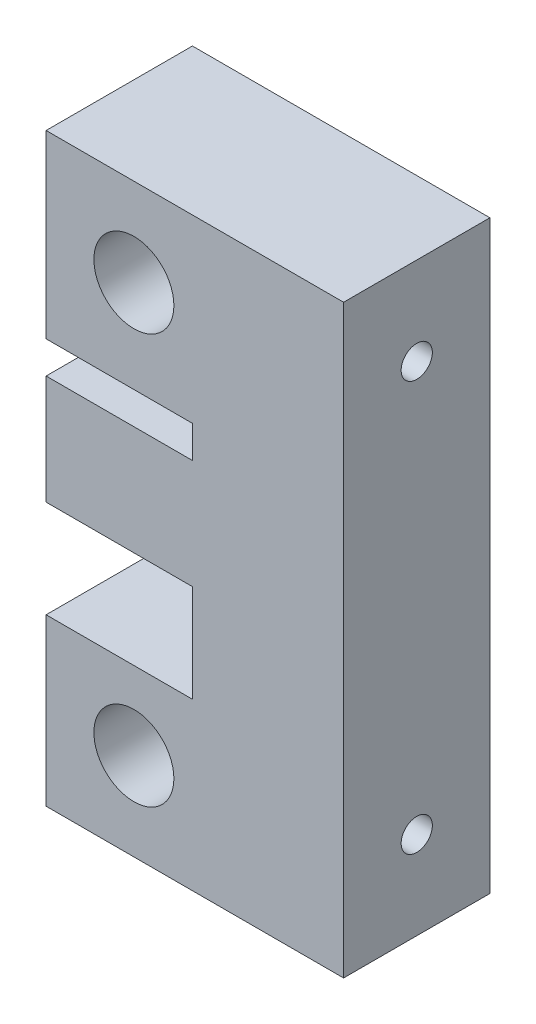
ISO-10303-21;
HEADER;
FILE_DESCRIPTION(('STEP AP214'),'2;1');
FILE_NAME('part.step','',(''),(''),'','','');
FILE_SCHEMA(('AUTOMOTIVE_DESIGN { 1 0 10303 214 1 1 1 1 }'));
ENDSEC;
DATA;
#1=APPLICATION_CONTEXT('core data for automotive mechanical design processes');
#2=APPLICATION_PROTOCOL_DEFINITION('international standard','automotive_design',2000,#1);
#3=PRODUCT_CONTEXT('',#1,'mechanical');
#4=PRODUCT('Part','Part','',(#3));
#5=PRODUCT_RELATED_PRODUCT_CATEGORY('part','',(#4));
#6=PRODUCT_DEFINITION_FORMATION('','',#4);
#7=PRODUCT_DEFINITION_CONTEXT('part definition',#1,'design');
#8=PRODUCT_DEFINITION('design','',#6,#7);
#9=PRODUCT_DEFINITION_SHAPE('','',#8);
#10=(LENGTH_UNIT() NAMED_UNIT(*) SI_UNIT(.MILLI.,.METRE.));
#11=(NAMED_UNIT(*) PLANE_ANGLE_UNIT() SI_UNIT($,.RADIAN.));
#12=(NAMED_UNIT(*) SI_UNIT($,.STERADIAN.) SOLID_ANGLE_UNIT());
#13=UNCERTAINTY_MEASURE_WITH_UNIT(LENGTH_MEASURE(1.E-05),#10,'distance_accuracy_value','');
#14=(GEOMETRIC_REPRESENTATION_CONTEXT(3) GLOBAL_UNCERTAINTY_ASSIGNED_CONTEXT((#13)) GLOBAL_UNIT_ASSIGNED_CONTEXT((#10,
#11,#12)) REPRESENTATION_CONTEXT('',''));
#15=CARTESIAN_POINT('',(0.,0.,0.));
#16=DIRECTION('',(0.,0.,1.));
#17=DIRECTION('',(1.,0.,0.));
#18=AXIS2_PLACEMENT_3D('',#15,#16,#17);
#19=CARTESIAN_POINT('',(-15.25,60.,-7.5));
#20=DIRECTION('',(1.,0.,0.));
#21=DIRECTION('',(0.,0.,-1.));
#22=AXIS2_PLACEMENT_3D('',#19,#20,#21);
#23=PLANE('',#22);
#24=DIRECTION('',(0.,-1.,0.));
#25=VECTOR('',#24,1.);
#26=CARTESIAN_POINT('',(-15.25,60.,-7.5));
#27=LINE('',#26,#25);
#28=CARTESIAN_POINT('',(-15.25,38.2,-7.5));
#29=VERTEX_POINT('',#28);
#30=CARTESIAN_POINT('',(-15.25,27.,-7.5));
#31=VERTEX_POINT('',#30);
#32=EDGE_CURVE('E144',#29,#31,#27,.T.);
#33=ORIENTED_EDGE('',*,*,#32,.T.);
#34=DIRECTION('',(0.,0.,1.));
#35=VECTOR('',#34,1.);
#36=CARTESIAN_POINT('',(-15.25,27.,-7.5));
#37=LINE('',#36,#35);
#38=CARTESIAN_POINT('',(-15.25,27.,7.5));
#39=VERTEX_POINT('',#38);
#40=EDGE_CURVE('E183',#31,#39,#37,.T.);
#41=ORIENTED_EDGE('',*,*,#40,.T.);
#42=DIRECTION('',(0.,-1.,0.));
#43=VECTOR('',#42,1.);
#44=CARTESIAN_POINT('',(-15.25,60.,7.5));
#45=LINE('',#44,#43);
#46=CARTESIAN_POINT('',(-15.25,38.2,7.5));
#47=VERTEX_POINT('',#46);
#48=EDGE_CURVE('E40',#47,#39,#45,.T.);
#49=ORIENTED_EDGE('',*,*,#48,.F.);
#50=DIRECTION('',(0.,0.,1.));
#51=VECTOR('',#50,1.);
#52=CARTESIAN_POINT('',(-15.25,38.2,-7.5));
#53=LINE('',#52,#51);
#54=EDGE_CURVE('E181',#29,#47,#53,.T.);
#55=ORIENTED_EDGE('',*,*,#54,.F.);
#56=EDGE_LOOP('',(#33,#41,#49,#55));
#57=FACE_BOUND('',#56,.T.);
#58=ADVANCED_FACE('F32',(#57),#23,.F.);
#59=CARTESIAN_POINT('',(-15.25,60.,-7.5));
#60=VERTEX_POINT('',#59);
#61=CARTESIAN_POINT('',(-15.25,41.5,-7.5));
#62=VERTEX_POINT('',#61);
#63=EDGE_CURVE('E147',#60,#62,#27,.T.);
#64=ORIENTED_EDGE('',*,*,#63,.T.);
#65=DIRECTION('',(0.,0.,1.));
#66=VECTOR('',#65,1.);
#67=CARTESIAN_POINT('',(-15.25,41.5,-7.5));
#68=LINE('',#67,#66);
#69=CARTESIAN_POINT('',(-15.25,41.5,7.5));
#70=VERTEX_POINT('',#69);
#71=EDGE_CURVE('E207',#62,#70,#68,.T.);
#72=ORIENTED_EDGE('',*,*,#71,.T.);
#73=CARTESIAN_POINT('',(-15.25,60.,7.5));
#74=VERTEX_POINT('',#73);
#75=EDGE_CURVE('E11',#74,#70,#45,.T.);
#76=ORIENTED_EDGE('',*,*,#75,.F.);
#77=DIRECTION('',(0.,0.,1.));
#78=VECTOR('',#77,1.);
#79=CARTESIAN_POINT('',(-15.25,60.,-7.5));
#80=LINE('',#79,#78);
#81=EDGE_CURVE('E227',#60,#74,#80,.T.);
#82=ORIENTED_EDGE('',*,*,#81,.F.);
#83=EDGE_LOOP('',(#64,#72,#76,#82));
#84=FACE_BOUND('',#83,.T.);
#85=ADVANCED_FACE('F243',(#84),#23,.F.);
#86=CARTESIAN_POINT('',(-15.25,17.,7.5));
#87=VERTEX_POINT('',#86);
#88=CARTESIAN_POINT('',(-15.25,0.,7.5));
#89=VERTEX_POINT('',#88);
#90=EDGE_CURVE('E41',#87,#89,#45,.T.);
#91=ORIENTED_EDGE('',*,*,#90,.F.);
#92=DIRECTION('',(0.,0.,1.));
#93=VECTOR('',#92,1.);
#94=CARTESIAN_POINT('',(-15.25,17.,-7.5));
#95=LINE('',#94,#93);
#96=CARTESIAN_POINT('',(-15.25,17.,-7.5));
#97=VERTEX_POINT('',#96);
#98=EDGE_CURVE('E125',#97,#87,#95,.T.);
#99=ORIENTED_EDGE('',*,*,#98,.F.);
#100=CARTESIAN_POINT('',(-15.25,0.,-7.5));
#101=VERTEX_POINT('',#100);
#102=EDGE_CURVE('E135',#97,#101,#27,.T.);
#103=ORIENTED_EDGE('',*,*,#102,.T.);
#104=DIRECTION('',(0.,0.,1.));
#105=VECTOR('',#104,1.);
#106=CARTESIAN_POINT('',(-15.25,0.,-7.5));
#107=LINE('',#106,#105);
#108=EDGE_CURVE('E224',#101,#89,#107,.T.);
#109=ORIENTED_EDGE('',*,*,#108,.T.);
#110=EDGE_LOOP('',(#91,#99,#103,#109));
#111=FACE_BOUND('',#110,.T.);
#112=ADVANCED_FACE('F34',(#111),#23,.F.);
#113=CARTESIAN_POINT('',(-15.25,60.,7.5));
#114=DIRECTION('',(0.,0.,-1.));
#115=DIRECTION('',(-1.,0.,0.));
#116=AXIS2_PLACEMENT_3D('',#113,#114,#115);
#117=PLANE('',#116);
#118=CARTESIAN_POINT('',(-6.25,9.,7.5));
#119=DIRECTION('',(0.,0.,1.));
#120=DIRECTION('',(1.,0.,0.));
#121=AXIS2_PLACEMENT_3D('',#118,#119,#120);
#122=CIRCLE('',#121,4.1);
#123=CARTESIAN_POINT('',(-2.15,9.,7.5));
#124=VERTEX_POINT('',#123);
#125=EDGE_CURVE('E209',#124,#124,#122,.T.);
#126=ORIENTED_EDGE('',*,*,#125,.F.);
#127=EDGE_LOOP('',(#126));
#128=FACE_BOUND('',#127,.T.);
#129=CARTESIAN_POINT('',(-6.25,51.,7.5));
#130=DIRECTION('',(0.,0.,1.));
#131=DIRECTION('',(1.,0.,0.));
#132=AXIS2_PLACEMENT_3D('',#129,#130,#131);
#133=CIRCLE('',#132,4.1);
#134=CARTESIAN_POINT('',(-2.15,51.,7.5));
#135=VERTEX_POINT('',#134);
#136=EDGE_CURVE('E218',#135,#135,#133,.T.);
#137=ORIENTED_EDGE('',*,*,#136,.F.);
#138=EDGE_LOOP('',(#137));
#139=FACE_BOUND('',#138,.T.);
#140=ORIENTED_EDGE('',*,*,#48,.T.);
#141=DIRECTION('',(-1.,0.,0.));
#142=VECTOR('',#141,1.);
#143=CARTESIAN_POINT('',(-15.25,27.,7.5));
#144=LINE('',#143,#142);
#145=CARTESIAN_POINT('',(-0.25,27.,7.5));
#146=VERTEX_POINT('',#145);
#147=EDGE_CURVE('E130',#146,#39,#144,.T.);
#148=ORIENTED_EDGE('',*,*,#147,.F.);
#149=DIRECTION('',(0.,1.,0.));
#150=VECTOR('',#149,1.);
#151=CARTESIAN_POINT('',(-0.25,17.,7.5));
#152=LINE('',#151,#150);
#153=CARTESIAN_POINT('',(-0.25,17.,7.5));
#154=VERTEX_POINT('',#153);
#155=EDGE_CURVE('E255',#154,#146,#152,.T.);
#156=ORIENTED_EDGE('',*,*,#155,.F.);
#157=DIRECTION('',(1.,0.,0.));
#158=VECTOR('',#157,1.);
#159=CARTESIAN_POINT('',(-15.25,17.,7.5));
#160=LINE('',#159,#158);
#161=EDGE_CURVE('E254',#87,#154,#160,.T.);
#162=ORIENTED_EDGE('',*,*,#161,.F.);
#163=ORIENTED_EDGE('',*,*,#90,.T.);
#164=DIRECTION('',(1.,0.,0.));
#165=VECTOR('',#164,1.);
#166=CARTESIAN_POINT('',(-15.25,0.,7.5));
#167=LINE('',#166,#165);
#168=CARTESIAN_POINT('',(15.25,0.,7.5));
#169=VERTEX_POINT('',#168);
#170=EDGE_CURVE('E234',#89,#169,#167,.T.);
#171=ORIENTED_EDGE('',*,*,#170,.T.);
#172=DIRECTION('',(0.,-1.,0.));
#173=VECTOR('',#172,1.);
#174=CARTESIAN_POINT('',(15.25,60.,7.5));
#175=LINE('',#174,#173);
#176=CARTESIAN_POINT('',(15.25,60.,7.5));
#177=VERTEX_POINT('',#176);
#178=EDGE_CURVE('E159',#177,#169,#175,.T.);
#179=ORIENTED_EDGE('',*,*,#178,.F.);
#180=DIRECTION('',(1.,0.,0.));
#181=VECTOR('',#180,1.);
#182=CARTESIAN_POINT('',(-15.25,60.,7.5));
#183=LINE('',#182,#181);
#184=EDGE_CURVE('E230',#74,#177,#183,.T.);
#185=ORIENTED_EDGE('',*,*,#184,.F.);
#186=ORIENTED_EDGE('',*,*,#75,.T.);
#187=DIRECTION('',(-1.,0.,0.));
#188=VECTOR('',#187,1.);
#189=CARTESIAN_POINT('',(-15.25,41.5,7.5));
#190=LINE('',#189,#188);
#191=CARTESIAN_POINT('',(-0.25,41.5,7.5));
#192=VERTEX_POINT('',#191);
#193=EDGE_CURVE('E199',#192,#70,#190,.T.);
#194=ORIENTED_EDGE('',*,*,#193,.F.);
#195=DIRECTION('',(0.,1.,0.));
#196=VECTOR('',#195,1.);
#197=CARTESIAN_POINT('',(-0.25,41.5,7.5));
#198=LINE('',#197,#196);
#199=CARTESIAN_POINT('',(-0.25,38.2,7.5));
#200=VERTEX_POINT('',#199);
#201=EDGE_CURVE('E189',#200,#192,#198,.T.);
#202=ORIENTED_EDGE('',*,*,#201,.F.);
#203=DIRECTION('',(1.,0.,0.));
#204=VECTOR('',#203,1.);
#205=CARTESIAN_POINT('',(-15.25,38.2,7.5));
#206=LINE('',#205,#204);
#207=EDGE_CURVE('E177',#47,#200,#206,.T.);
#208=ORIENTED_EDGE('',*,*,#207,.F.);
#209=EDGE_LOOP('',(#140,#148,#156,#162,#163,#171,#179,#185,#186,#194,#202,#208));
#210=FACE_BOUND('',#209,.T.);
#211=ADVANCED_FACE('F173',(#128,#139,#210),#117,.F.);
#212=CARTESIAN_POINT('',(15.25,60.,-7.5));
#213=DIRECTION('',(-1.,0.,0.));
#214=DIRECTION('',(0.,0.,1.));
#215=AXIS2_PLACEMENT_3D('',#212,#213,#214);
#216=PLANE('',#215);
#217=CARTESIAN_POINT('',(15.25,9.,0.));
#218=DIRECTION('',(1.,0.,0.));
#219=DIRECTION('',(0.,0.,-1.));
#220=AXIS2_PLACEMENT_3D('',#217,#218,#219);
#221=CIRCLE('',#220,1.6);
#222=CARTESIAN_POINT('',(15.25,9.,-1.6));
#223=VERTEX_POINT('',#222);
#224=EDGE_CURVE('E391',#223,#223,#221,.T.);
#225=ORIENTED_EDGE('',*,*,#224,.F.);
#226=EDGE_LOOP('',(#225));
#227=FACE_BOUND('',#226,.T.);
#228=CARTESIAN_POINT('',(15.25,51.,0.));
#229=DIRECTION('',(1.,0.,0.));
#230=DIRECTION('',(0.,0.,-1.));
#231=AXIS2_PLACEMENT_3D('',#228,#229,#230);
#232=CIRCLE('',#231,1.6);
#233=CARTESIAN_POINT('',(15.25,51.,-1.6));
#234=VERTEX_POINT('',#233);
#235=EDGE_CURVE('E390',#234,#234,#232,.T.);
#236=ORIENTED_EDGE('',*,*,#235,.F.);
#237=EDGE_LOOP('',(#236));
#238=FACE_BOUND('',#237,.T.);
#239=DIRECTION('',(0.,0.,-1.));
#240=VECTOR('',#239,1.);
#241=CARTESIAN_POINT('',(15.25,0.,-7.5));
#242=LINE('',#241,#240);
#243=CARTESIAN_POINT('',(15.25,0.,-7.5));
#244=VERTEX_POINT('',#243);
#245=EDGE_CURVE('E236',#169,#244,#242,.T.);
#246=ORIENTED_EDGE('',*,*,#245,.T.);
#247=DIRECTION('',(0.,-1.,0.));
#248=VECTOR('',#247,1.);
#249=CARTESIAN_POINT('',(15.25,60.,-7.5));
#250=LINE('',#249,#248);
#251=CARTESIAN_POINT('',(15.25,60.,-7.5));
#252=VERTEX_POINT('',#251);
#253=EDGE_CURVE('E154',#252,#244,#250,.T.);
#254=ORIENTED_EDGE('',*,*,#253,.F.);
#255=DIRECTION('',(0.,0.,-1.));
#256=VECTOR('',#255,1.);
#257=CARTESIAN_POINT('',(15.25,60.,-7.5));
#258=LINE('',#257,#256);
#259=EDGE_CURVE('E149',#177,#252,#258,.T.);
#260=ORIENTED_EDGE('',*,*,#259,.F.);
#261=ORIENTED_EDGE('',*,*,#178,.T.);
#262=EDGE_LOOP('',(#246,#254,#260,#261));
#263=FACE_BOUND('',#262,.T.);
#264=ADVANCED_FACE('F237',(#227,#238,#263),#216,.F.);
#265=CARTESIAN_POINT('',(-15.25,60.,-7.5));
#266=DIRECTION('',(0.,0.,1.));
#267=DIRECTION('',(1.,0.,0.));
#268=AXIS2_PLACEMENT_3D('',#265,#266,#267);
#269=PLANE('',#268);
#270=CARTESIAN_POINT('',(-6.25,9.,-7.5));
#271=DIRECTION('',(0.,0.,1.));
#272=DIRECTION('',(1.,0.,0.));
#273=AXIS2_PLACEMENT_3D('',#270,#271,#272);
#274=CIRCLE('',#273,4.1);
#275=CARTESIAN_POINT('',(-2.15,9.,-7.5));
#276=VERTEX_POINT('',#275);
#277=EDGE_CURVE('E215',#276,#276,#274,.T.);
#278=ORIENTED_EDGE('',*,*,#277,.T.);
#279=EDGE_LOOP('',(#278));
#280=FACE_BOUND('',#279,.T.);
#281=CARTESIAN_POINT('',(-6.25,51.,-7.5));
#282=DIRECTION('',(0.,0.,1.));
#283=DIRECTION('',(1.,0.,0.));
#284=AXIS2_PLACEMENT_3D('',#281,#282,#283);
#285=CIRCLE('',#284,4.1);
#286=CARTESIAN_POINT('',(-2.15,51.,-7.5));
#287=VERTEX_POINT('',#286);
#288=EDGE_CURVE('E221',#287,#287,#285,.T.);
#289=ORIENTED_EDGE('',*,*,#288,.T.);
#290=EDGE_LOOP('',(#289));
#291=FACE_BOUND('',#290,.T.);
#292=DIRECTION('',(0.,1.,0.));
#293=VECTOR('',#292,1.);
#294=CARTESIAN_POINT('',(-0.25,17.,-7.5));
#295=LINE('',#294,#293);
#296=CARTESIAN_POINT('',(-0.25,17.,-7.5));
#297=VERTEX_POINT('',#296);
#298=CARTESIAN_POINT('',(-0.25,27.,-7.5));
#299=VERTEX_POINT('',#298);
#300=EDGE_CURVE('E48',#297,#299,#295,.T.);
#301=ORIENTED_EDGE('',*,*,#300,.T.);
#302=DIRECTION('',(-1.,0.,0.));
#303=VECTOR('',#302,1.);
#304=CARTESIAN_POINT('',(-15.25,27.,-7.5));
#305=LINE('',#304,#303);
#306=EDGE_CURVE('E137',#299,#31,#305,.T.);
#307=ORIENTED_EDGE('',*,*,#306,.T.);
#308=ORIENTED_EDGE('',*,*,#32,.F.);
#309=DIRECTION('',(1.,0.,0.));
#310=VECTOR('',#309,1.);
#311=CARTESIAN_POINT('',(-15.25,38.2,-7.5));
#312=LINE('',#311,#310);
#313=CARTESIAN_POINT('',(-0.25,38.2,-7.5));
#314=VERTEX_POINT('',#313);
#315=EDGE_CURVE('E196',#29,#314,#312,.T.);
#316=ORIENTED_EDGE('',*,*,#315,.T.);
#317=DIRECTION('',(0.,1.,0.));
#318=VECTOR('',#317,1.);
#319=CARTESIAN_POINT('',(-0.25,41.5,-7.5));
#320=LINE('',#319,#318);
#321=CARTESIAN_POINT('',(-0.25,41.5,-7.5));
#322=VERTEX_POINT('',#321);
#323=EDGE_CURVE('E56',#314,#322,#320,.T.);
#324=ORIENTED_EDGE('',*,*,#323,.T.);
#325=DIRECTION('',(-1.,0.,0.));
#326=VECTOR('',#325,1.);
#327=CARTESIAN_POINT('',(-15.25,41.5,-7.5));
#328=LINE('',#327,#326);
#329=EDGE_CURVE('E201',#322,#62,#328,.T.);
#330=ORIENTED_EDGE('',*,*,#329,.T.);
#331=ORIENTED_EDGE('',*,*,#63,.F.);
#332=DIRECTION('',(-1.,0.,0.));
#333=VECTOR('',#332,1.);
#334=CARTESIAN_POINT('',(-15.25,60.,-7.5));
#335=LINE('',#334,#333);
#336=EDGE_CURVE('E145',#252,#60,#335,.T.);
#337=ORIENTED_EDGE('',*,*,#336,.F.);
#338=ORIENTED_EDGE('',*,*,#253,.T.);
#339=DIRECTION('',(-1.,0.,0.));
#340=VECTOR('',#339,1.);
#341=CARTESIAN_POINT('',(-15.25,0.,-7.5));
#342=LINE('',#341,#340);
#343=EDGE_CURVE('E142',#244,#101,#342,.T.);
#344=ORIENTED_EDGE('',*,*,#343,.T.);
#345=ORIENTED_EDGE('',*,*,#102,.F.);
#346=DIRECTION('',(1.,0.,0.));
#347=VECTOR('',#346,1.);
#348=CARTESIAN_POINT('',(-15.25,17.,-7.5));
#349=LINE('',#348,#347);
#350=EDGE_CURVE('E121',#97,#297,#349,.T.);
#351=ORIENTED_EDGE('',*,*,#350,.T.);
#352=EDGE_LOOP('',(#301,#307,#308,#316,#324,#330,#331,#337,#338,#344,#345,#351));
#353=FACE_BOUND('',#352,.T.);
#354=ADVANCED_FACE('F139',(#280,#291,#353),#269,.F.);
#355=CARTESIAN_POINT('',(-15.25,60.,7.5));
#356=DIRECTION('',(0.,1.,0.));
#357=DIRECTION('',(0.,0.,1.));
#358=AXIS2_PLACEMENT_3D('',#355,#356,#357);
#359=PLANE('',#358);
#360=ORIENTED_EDGE('',*,*,#81,.T.);
#361=ORIENTED_EDGE('',*,*,#184,.T.);
#362=ORIENTED_EDGE('',*,*,#259,.T.);
#363=ORIENTED_EDGE('',*,*,#336,.T.);
#364=EDGE_LOOP('',(#360,#361,#362,#363));
#365=FACE_BOUND('',#364,.T.);
#366=ADVANCED_FACE('F241',(#365),#359,.T.);
#367=CARTESIAN_POINT('',(-15.25,0.,7.5));
#368=DIRECTION('',(0.,1.,0.));
#369=DIRECTION('',(0.,0.,1.));
#370=AXIS2_PLACEMENT_3D('',#367,#368,#369);
#371=PLANE('',#370);
#372=ORIENTED_EDGE('',*,*,#108,.F.);
#373=ORIENTED_EDGE('',*,*,#343,.F.);
#374=ORIENTED_EDGE('',*,*,#245,.F.);
#375=ORIENTED_EDGE('',*,*,#170,.F.);
#376=EDGE_LOOP('',(#372,#373,#374,#375));
#377=FACE_BOUND('',#376,.T.);
#378=ADVANCED_FACE('F239',(#377),#371,.F.);
#379=CARTESIAN_POINT('',(-6.25,51.,-7.5));
#380=DIRECTION('',(0.,0.,1.));
#381=DIRECTION('',(1.,0.,0.));
#382=AXIS2_PLACEMENT_3D('',#379,#380,#381);
#383=CYLINDRICAL_SURFACE('',#382,4.1);
#384=ORIENTED_EDGE('',*,*,#288,.F.);
#385=EDGE_LOOP('',(#384));
#386=FACE_BOUND('',#385,.T.);
#387=ORIENTED_EDGE('',*,*,#136,.T.);
#388=EDGE_LOOP('',(#387));
#389=FACE_BOUND('',#388,.T.);
#390=ADVANCED_FACE('F291',(#386,#389),#383,.F.);
#391=CARTESIAN_POINT('',(-6.25,9.,-7.5));
#392=DIRECTION('',(0.,0.,1.));
#393=DIRECTION('',(1.,0.,0.));
#394=AXIS2_PLACEMENT_3D('',#391,#392,#393);
#395=CYLINDRICAL_SURFACE('',#394,4.1);
#396=ORIENTED_EDGE('',*,*,#277,.F.);
#397=EDGE_LOOP('',(#396));
#398=FACE_BOUND('',#397,.T.);
#399=ORIENTED_EDGE('',*,*,#125,.T.);
#400=EDGE_LOOP('',(#399));
#401=FACE_BOUND('',#400,.T.);
#402=ADVANCED_FACE('F296',(#398,#401),#395,.F.);
#403=CARTESIAN_POINT('',(-15.25,41.5,-7.5));
#404=DIRECTION('',(0.,1.,0.));
#405=DIRECTION('',(0.,0.,1.));
#406=AXIS2_PLACEMENT_3D('',#403,#404,#405);
#407=PLANE('',#406);
#408=ORIENTED_EDGE('',*,*,#193,.T.);
#409=ORIENTED_EDGE('',*,*,#71,.F.);
#410=ORIENTED_EDGE('',*,*,#329,.F.);
#411=DIRECTION('',(0.,0.,1.));
#412=VECTOR('',#411,1.);
#413=CARTESIAN_POINT('',(-0.25,41.5,-7.5));
#414=LINE('',#413,#412);
#415=EDGE_CURVE('E210',#322,#192,#414,.T.);
#416=ORIENTED_EDGE('',*,*,#415,.T.);
#417=EDGE_LOOP('',(#408,#409,#410,#416));
#418=FACE_BOUND('',#417,.T.);
#419=ADVANCED_FACE('F246',(#418),#407,.F.);
#420=CARTESIAN_POINT('',(-0.25,41.5,-7.5));
#421=DIRECTION('',(1.,0.,0.));
#422=DIRECTION('',(0.,1.,0.));
#423=AXIS2_PLACEMENT_3D('',#420,#421,#422);
#424=PLANE('',#423);
#425=ORIENTED_EDGE('',*,*,#201,.T.);
#426=ORIENTED_EDGE('',*,*,#415,.F.);
#427=ORIENTED_EDGE('',*,*,#323,.F.);
#428=DIRECTION('',(0.,0.,1.));
#429=VECTOR('',#428,1.);
#430=CARTESIAN_POINT('',(-0.25,38.2,-7.5));
#431=LINE('',#430,#429);
#432=EDGE_CURVE('E212',#314,#200,#431,.T.);
#433=ORIENTED_EDGE('',*,*,#432,.T.);
#434=EDGE_LOOP('',(#425,#426,#427,#433));
#435=FACE_BOUND('',#434,.T.);
#436=ADVANCED_FACE('F248',(#435),#424,.F.);
#437=CARTESIAN_POINT('',(-15.25,38.2,-7.5));
#438=DIRECTION('',(0.,-1.,0.));
#439=DIRECTION('',(0.,0.,-1.));
#440=AXIS2_PLACEMENT_3D('',#437,#438,#439);
#441=PLANE('',#440);
#442=ORIENTED_EDGE('',*,*,#207,.T.);
#443=ORIENTED_EDGE('',*,*,#432,.F.);
#444=ORIENTED_EDGE('',*,*,#315,.F.);
#445=ORIENTED_EDGE('',*,*,#54,.T.);
#446=EDGE_LOOP('',(#442,#443,#444,#445));
#447=FACE_BOUND('',#446,.T.);
#448=ADVANCED_FACE('F250',(#447),#441,.F.);
#449=CARTESIAN_POINT('',(-15.25,27.,-7.5));
#450=DIRECTION('',(0.,1.,0.));
#451=DIRECTION('',(0.,0.,1.));
#452=AXIS2_PLACEMENT_3D('',#449,#450,#451);
#453=PLANE('',#452);
#454=ORIENTED_EDGE('',*,*,#147,.T.);
#455=ORIENTED_EDGE('',*,*,#40,.F.);
#456=ORIENTED_EDGE('',*,*,#306,.F.);
#457=DIRECTION('',(0.,0.,1.));
#458=VECTOR('',#457,1.);
#459=CARTESIAN_POINT('',(-0.25,27.,-7.5));
#460=LINE('',#459,#458);
#461=EDGE_CURVE('E187',#299,#146,#460,.T.);
#462=ORIENTED_EDGE('',*,*,#461,.T.);
#463=EDGE_LOOP('',(#454,#455,#456,#462));
#464=FACE_BOUND('',#463,.T.);
#465=ADVANCED_FACE('F258',(#464),#453,.F.);
#466=CARTESIAN_POINT('',(-0.25,17.,-7.5));
#467=DIRECTION('',(1.,0.,0.));
#468=DIRECTION('',(0.,0.,-1.));
#469=AXIS2_PLACEMENT_3D('',#466,#467,#468);
#470=PLANE('',#469);
#471=ORIENTED_EDGE('',*,*,#155,.T.);
#472=ORIENTED_EDGE('',*,*,#461,.F.);
#473=ORIENTED_EDGE('',*,*,#300,.F.);
#474=DIRECTION('',(0.,0.,1.));
#475=VECTOR('',#474,1.);
#476=CARTESIAN_POINT('',(-0.25,17.,-7.5));
#477=LINE('',#476,#475);
#478=EDGE_CURVE('E127',#297,#154,#477,.T.);
#479=ORIENTED_EDGE('',*,*,#478,.T.);
#480=EDGE_LOOP('',(#471,#472,#473,#479));
#481=FACE_BOUND('',#480,.T.);
#482=ADVANCED_FACE('F259',(#481),#470,.F.);
#483=CARTESIAN_POINT('',(-15.25,17.,-7.5));
#484=DIRECTION('',(0.,-1.,0.));
#485=DIRECTION('',(0.,0.,-1.));
#486=AXIS2_PLACEMENT_3D('',#483,#484,#485);
#487=PLANE('',#486);
#488=ORIENTED_EDGE('',*,*,#161,.T.);
#489=ORIENTED_EDGE('',*,*,#478,.F.);
#490=ORIENTED_EDGE('',*,*,#350,.F.);
#491=ORIENTED_EDGE('',*,*,#98,.T.);
#492=EDGE_LOOP('',(#488,#489,#490,#491));
#493=FACE_BOUND('',#492,.T.);
#494=ADVANCED_FACE('F124',(#493),#487,.F.);
#495=CARTESIAN_POINT('',(0.25,51.,0.));
#496=DIRECTION('',(1.,0.,0.));
#497=DIRECTION('',(0.,0.,-1.));
#498=AXIS2_PLACEMENT_3D('',#495,#496,#497);
#499=CYLINDRICAL_SURFACE('',#498,1.6);
#500=CARTESIAN_POINT('',(0.25,51.,0.));
#501=DIRECTION('',(1.,0.,0.));
#502=DIRECTION('',(0.,0.,-1.));
#503=AXIS2_PLACEMENT_3D('',#500,#501,#502);
#504=CIRCLE('',#503,1.6);
#505=CARTESIAN_POINT('',(0.25,51.,-1.6));
#506=VERTEX_POINT('',#505);
#507=EDGE_CURVE('E256',#506,#506,#504,.T.);
#508=ORIENTED_EDGE('',*,*,#507,.F.);
#509=EDGE_LOOP('',(#508));
#510=FACE_BOUND('',#509,.T.);
#511=ORIENTED_EDGE('',*,*,#235,.T.);
#512=EDGE_LOOP('',(#511));
#513=FACE_BOUND('',#512,.T.);
#514=ADVANCED_FACE('F266',(#510,#513),#499,.F.);
#515=CARTESIAN_POINT('',(0.25,51.,0.));
#516=DIRECTION('',(1.,0.,0.));
#517=DIRECTION('',(0.,0.,-1.));
#518=AXIS2_PLACEMENT_3D('',#515,#516,#517);
#519=PLANE('',#518);
#520=ORIENTED_EDGE('',*,*,#507,.T.);
#521=EDGE_LOOP('',(#520));
#522=FACE_BOUND('',#521,.T.);
#523=ADVANCED_FACE('F353',(#522),#519,.T.);
#524=CARTESIAN_POINT('',(0.25,9.,0.));
#525=DIRECTION('',(1.,0.,0.));
#526=DIRECTION('',(0.,0.,-1.));
#527=AXIS2_PLACEMENT_3D('',#524,#525,#526);
#528=CYLINDRICAL_SURFACE('',#527,1.6);
#529=CARTESIAN_POINT('',(0.25,9.,0.));
#530=DIRECTION('',(1.,0.,0.));
#531=DIRECTION('',(0.,0.,-1.));
#532=AXIS2_PLACEMENT_3D('',#529,#530,#531);
#533=CIRCLE('',#532,1.6);
#534=CARTESIAN_POINT('',(0.25,9.,-1.6));
#535=VERTEX_POINT('',#534);
#536=EDGE_CURVE('E389',#535,#535,#533,.T.);
#537=ORIENTED_EDGE('',*,*,#536,.F.);
#538=EDGE_LOOP('',(#537));
#539=FACE_BOUND('',#538,.T.);
#540=ORIENTED_EDGE('',*,*,#224,.T.);
#541=EDGE_LOOP('',(#540));
#542=FACE_BOUND('',#541,.T.);
#543=ADVANCED_FACE('F363',(#539,#542),#528,.F.);
#544=CARTESIAN_POINT('',(0.25,9.,0.));
#545=DIRECTION('',(1.,0.,0.));
#546=DIRECTION('',(0.,0.,-1.));
#547=AXIS2_PLACEMENT_3D('',#544,#545,#546);
#548=PLANE('',#547);
#549=ORIENTED_EDGE('',*,*,#536,.T.);
#550=EDGE_LOOP('',(#549));
#551=FACE_BOUND('',#550,.T.);
#552=ADVANCED_FACE('F373',(#551),#548,.T.);
#553=CLOSED_SHELL('',(#58,#85,#112,#211,#264,#354,#366,#378,#390,#402,#419,#436,#448,#465,#482,
#494,#514,#523,#543,#552));
#554=MANIFOLD_SOLID_BREP('B2',#553);
#555=ADVANCED_BREP_SHAPE_REPRESENTATION('',(#18,#554),#14);
#556=SHAPE_DEFINITION_REPRESENTATION(#9,#555);
ENDSEC;
END-ISO-10303-21;
